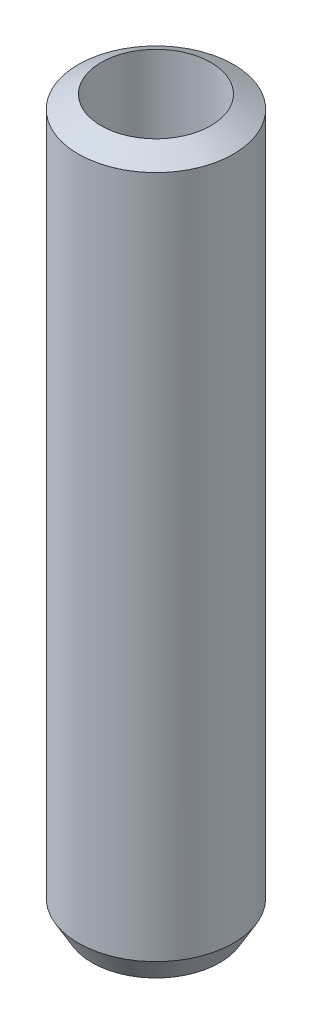
ISO-10303-21;
HEADER;
FILE_DESCRIPTION(('STEP AP214'),'2;1');
FILE_NAME('part.step','',(''),(''),'','','');
FILE_SCHEMA(('AUTOMOTIVE_DESIGN { 1 0 10303 214 1 1 1 1 }'));
ENDSEC;
DATA;
#1=APPLICATION_CONTEXT('core data for automotive mechanical design processes');
#2=APPLICATION_PROTOCOL_DEFINITION('international standard','automotive_design',2000,#1);
#3=PRODUCT_CONTEXT('',#1,'mechanical');
#4=PRODUCT('Part','Part','',(#3));
#5=PRODUCT_RELATED_PRODUCT_CATEGORY('part','',(#4));
#6=PRODUCT_DEFINITION_FORMATION('','',#4);
#7=PRODUCT_DEFINITION_CONTEXT('part definition',#1,'design');
#8=PRODUCT_DEFINITION('design','',#6,#7);
#9=PRODUCT_DEFINITION_SHAPE('','',#8);
#10=(LENGTH_UNIT() NAMED_UNIT(*) SI_UNIT(.MILLI.,.METRE.));
#11=(NAMED_UNIT(*) PLANE_ANGLE_UNIT() SI_UNIT($,.RADIAN.));
#12=(NAMED_UNIT(*) SI_UNIT($,.STERADIAN.) SOLID_ANGLE_UNIT());
#13=UNCERTAINTY_MEASURE_WITH_UNIT(LENGTH_MEASURE(1.E-05),#10,'distance_accuracy_value','');
#14=(GEOMETRIC_REPRESENTATION_CONTEXT(3) GLOBAL_UNCERTAINTY_ASSIGNED_CONTEXT((#13)) GLOBAL_UNIT_ASSIGNED_CONTEXT((#10,
#11,#12)) REPRESENTATION_CONTEXT('',''));
#15=CARTESIAN_POINT('',(0.,0.,0.));
#16=DIRECTION('',(0.,0.,1.));
#17=DIRECTION('',(1.,0.,0.));
#18=AXIS2_PLACEMENT_3D('',#15,#16,#17);
#19=CARTESIAN_POINT('',(0.,185.818910986171,0.));
#20=DIRECTION('',(0.,-1.,0.));
#21=DIRECTION('',(0.,0.,-1.));
#22=AXIS2_PLACEMENT_3D('',#19,#20,#21);
#23=CYLINDRICAL_SURFACE('',#22,20.);
#24=CARTESIAN_POINT('',(0.,182.255762510651,0.));
#25=DIRECTION('',(0.,1.,0.));
#26=DIRECTION('',(0.,0.,1.));
#27=AXIS2_PLACEMENT_3D('',#24,#25,#26);
#28=CIRCLE('',#27,20.);
#29=CARTESIAN_POINT('',(0.,182.255762510651,20.));
#30=VERTEX_POINT('',#29);
#31=EDGE_CURVE('E50',#30,#30,#28,.F.);
#32=ORIENTED_EDGE('',*,*,#31,.T.);
#33=EDGE_LOOP('',(#32));
#34=FACE_BOUND('',#33,.T.);
#35=CARTESIAN_POINT('',(0.,6.17155419451282,0.));
#36=DIRECTION('',(0.,1.,0.));
#37=DIRECTION('',(0.,0.,1.));
#38=AXIS2_PLACEMENT_3D('',#35,#36,#37);
#39=CIRCLE('',#38,20.);
#40=CARTESIAN_POINT('',(0.,6.17155419451282,20.));
#41=VERTEX_POINT('',#40);
#42=EDGE_CURVE('E51',#41,#41,#39,.T.);
#43=ORIENTED_EDGE('',*,*,#42,.T.);
#44=EDGE_LOOP('',(#43));
#45=FACE_BOUND('',#44,.T.);
#46=ADVANCED_FACE('F39',(#34,#45),#23,.T.);
#47=CARTESIAN_POINT('',(0.,0.,0.));
#48=DIRECTION('',(0.,1.,0.));
#49=DIRECTION('',(0.,0.,1.));
#50=AXIS2_PLACEMENT_3D('',#47,#48,#49);
#51=PLANE('',#50);
#52=CARTESIAN_POINT('',(0.,0.,0.));
#53=DIRECTION('',(0.,1.,0.));
#54=DIRECTION('',(0.,0.,1.));
#55=AXIS2_PLACEMENT_3D('',#52,#53,#54);
#56=CIRCLE('',#55,16.4368515244796);
#57=CARTESIAN_POINT('',(0.,0.,16.4368515244796));
#58=VERTEX_POINT('',#57);
#59=EDGE_CURVE('E10',#58,#58,#56,.F.);
#60=ORIENTED_EDGE('',*,*,#59,.T.);
#61=EDGE_LOOP('',(#60));
#62=FACE_BOUND('',#61,.T.);
#63=CARTESIAN_POINT('',(0.,0.,0.));
#64=DIRECTION('',(0.,1.,0.));
#65=DIRECTION('',(0.,0.,1.));
#66=AXIS2_PLACEMENT_3D('',#63,#64,#65);
#67=CIRCLE('',#66,14.1351898850246);
#68=CARTESIAN_POINT('',(0.,0.,14.1351898850246));
#69=VERTEX_POINT('',#68);
#70=EDGE_CURVE('E58',#69,#69,#67,.T.);
#71=ORIENTED_EDGE('',*,*,#70,.T.);
#72=EDGE_LOOP('',(#71));
#73=FACE_BOUND('',#72,.T.);
#74=ADVANCED_FACE('F62',(#62,#73),#51,.F.);
#75=CARTESIAN_POINT('',(0.,185.818910986171,0.));
#76=DIRECTION('',(0.,-1.,0.));
#77=DIRECTION('',(0.,0.,-1.));
#78=AXIS2_PLACEMENT_3D('',#75,#76,#77);
#79=CYLINDRICAL_SURFACE('',#78,14.1351898850246);
#80=CARTESIAN_POINT('',(0.,185.641812209278,0.));
#81=DIRECTION('',(0.,-1.,0.));
#82=DIRECTION('',(0.,0.,-1.));
#83=AXIS2_PLACEMENT_3D('',#80,#81,#82);
#84=CIRCLE('',#83,14.1351898850246);
#85=CARTESIAN_POINT('',(0.,185.641812209278,-14.1351898850246));
#86=VERTEX_POINT('',#85);
#87=EDGE_CURVE('E54',#86,#86,#84,.F.);
#88=ORIENTED_EDGE('',*,*,#87,.T.);
#89=EDGE_LOOP('',(#88));
#90=FACE_BOUND('',#89,.T.);
#91=ORIENTED_EDGE('',*,*,#70,.F.);
#92=EDGE_LOOP('',(#91));
#93=FACE_BOUND('',#92,.T.);
#94=ADVANCED_FACE('F68',(#90,#93),#79,.F.);
#95=CARTESIAN_POINT('',(0.,185.818910986171,0.));
#96=DIRECTION('',(0.,-1.,0.));
#97=DIRECTION('',(0.,0.,-1.));
#98=AXIS2_PLACEMENT_3D('',#95,#96,#97);
#99=CONICAL_SURFACE('',#98,13.828445805487,1.0471975511966);
#100=ORIENTED_EDGE('',*,*,#31,.F.);
#101=EDGE_LOOP('',(#100));
#102=FACE_BOUND('',#101,.T.);
#103=ORIENTED_EDGE('',*,*,#87,.F.);
#104=EDGE_LOOP('',(#103));
#105=FACE_BOUND('',#104,.T.);
#106=ADVANCED_FACE('F66',(#102,#105),#99,.T.);
#107=CARTESIAN_POINT('',(0.,6.17155419451282,0.));
#108=DIRECTION('',(0.,1.,0.));
#109=DIRECTION('',(0.,0.,1.));
#110=AXIS2_PLACEMENT_3D('',#107,#108,#109);
#111=CONICAL_SURFACE('',#110,20.,0.523598775598303);
#112=ORIENTED_EDGE('',*,*,#59,.F.);
#113=EDGE_LOOP('',(#112));
#114=FACE_BOUND('',#113,.T.);
#115=ORIENTED_EDGE('',*,*,#42,.F.);
#116=EDGE_LOOP('',(#115));
#117=FACE_BOUND('',#116,.T.);
#118=ADVANCED_FACE('F45',(#114,#117),#111,.T.);
#119=CLOSED_SHELL('',(#46,#74,#94,#106,#118));
#120=MANIFOLD_SOLID_BREP('B2',#119);
#121=ADVANCED_BREP_SHAPE_REPRESENTATION('',(#18,#120),#14);
#122=SHAPE_DEFINITION_REPRESENTATION(#9,#121);
ENDSEC;
END-ISO-10303-21;
